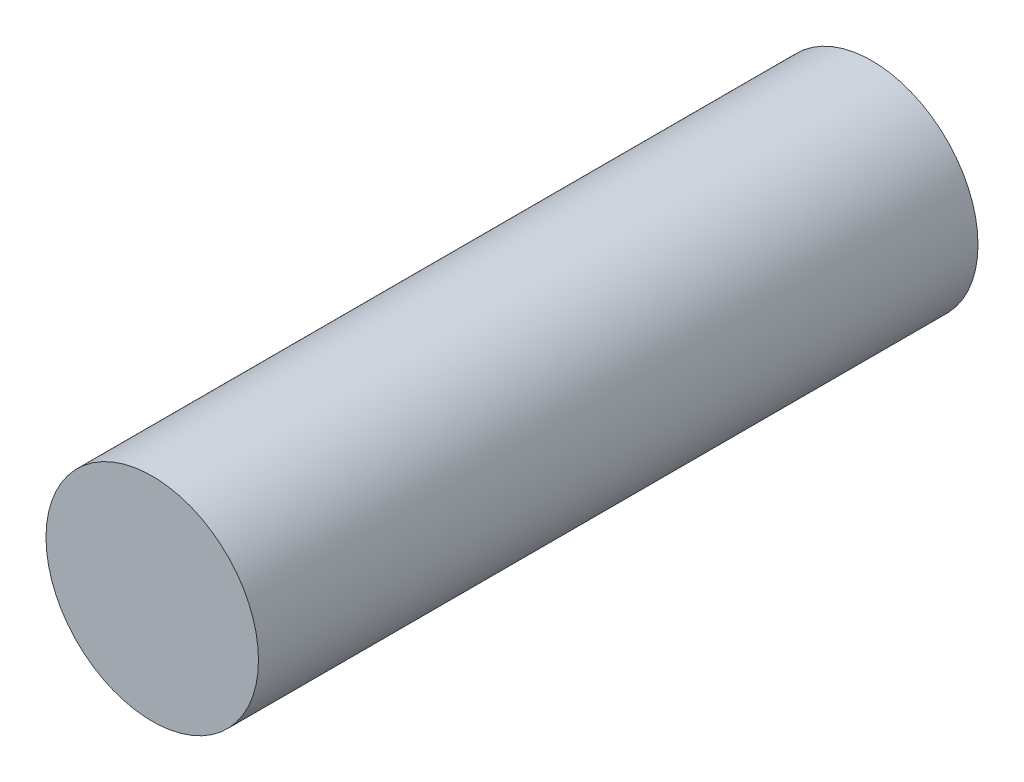
ISO-10303-21;
HEADER;
FILE_DESCRIPTION(('STEP AP214'),'2;1');
FILE_NAME('part.step','',(''),(''),'','','');
FILE_SCHEMA(('AUTOMOTIVE_DESIGN { 1 0 10303 214 1 1 1 1 }'));
ENDSEC;
DATA;
#1=APPLICATION_CONTEXT('core data for automotive mechanical design processes');
#2=APPLICATION_PROTOCOL_DEFINITION('international standard','automotive_design',2000,#1);
#3=PRODUCT_CONTEXT('',#1,'mechanical');
#4=PRODUCT('Part','Part','',(#3));
#5=PRODUCT_RELATED_PRODUCT_CATEGORY('part','',(#4));
#6=PRODUCT_DEFINITION_FORMATION('','',#4);
#7=PRODUCT_DEFINITION_CONTEXT('part definition',#1,'design');
#8=PRODUCT_DEFINITION('design','',#6,#7);
#9=PRODUCT_DEFINITION_SHAPE('','',#8);
#10=(LENGTH_UNIT() NAMED_UNIT(*) SI_UNIT(.MILLI.,.METRE.));
#11=(NAMED_UNIT(*) PLANE_ANGLE_UNIT() SI_UNIT($,.RADIAN.));
#12=(NAMED_UNIT(*) SI_UNIT($,.STERADIAN.) SOLID_ANGLE_UNIT());
#13=UNCERTAINTY_MEASURE_WITH_UNIT(LENGTH_MEASURE(1.E-05),#10,'distance_accuracy_value','');
#14=(GEOMETRIC_REPRESENTATION_CONTEXT(3) GLOBAL_UNCERTAINTY_ASSIGNED_CONTEXT((#13)) GLOBAL_UNIT_ASSIGNED_CONTEXT((#10,
#11,#12)) REPRESENTATION_CONTEXT('',''));
#15=CARTESIAN_POINT('',(0.,0.,0.));
#16=DIRECTION('',(0.,0.,1.));
#17=DIRECTION('',(1.,0.,0.));
#18=AXIS2_PLACEMENT_3D('',#15,#16,#17);
#19=CARTESIAN_POINT('',(0.,0.,150.));
#20=DIRECTION('',(0.,0.,-1.));
#21=DIRECTION('',(-1.,0.,0.));
#22=AXIS2_PLACEMENT_3D('',#19,#20,#21);
#23=CYLINDRICAL_SURFACE('',#22,22.1470871818092);
#24=CARTESIAN_POINT('',(0.,0.,150.));
#25=DIRECTION('',(0.,0.,1.));
#26=DIRECTION('',(1.,0.,0.));
#27=AXIS2_PLACEMENT_3D('',#24,#25,#26);
#28=CIRCLE('',#27,22.1470871818092);
#29=CARTESIAN_POINT('',(22.1470871818092,0.,150.));
#30=VERTEX_POINT('',#29);
#31=EDGE_CURVE('E10',#30,#30,#28,.T.);
#32=ORIENTED_EDGE('',*,*,#31,.F.);
#33=EDGE_LOOP('',(#32));
#34=FACE_BOUND('',#33,.T.);
#35=CARTESIAN_POINT('',(0.,0.,0.));
#36=DIRECTION('',(0.,0.,1.));
#37=DIRECTION('',(1.,0.,0.));
#38=AXIS2_PLACEMENT_3D('',#35,#36,#37);
#39=CIRCLE('',#38,22.1470871818092);
#40=CARTESIAN_POINT('',(22.1470871818092,0.,0.));
#41=VERTEX_POINT('',#40);
#42=EDGE_CURVE('E34',#41,#41,#39,.T.);
#43=ORIENTED_EDGE('',*,*,#42,.T.);
#44=EDGE_LOOP('',(#43));
#45=FACE_BOUND('',#44,.T.);
#46=ADVANCED_FACE('F31',(#34,#45),#23,.T.);
#47=CARTESIAN_POINT('',(0.,0.,150.));
#48=DIRECTION('',(0.,0.,1.));
#49=DIRECTION('',(1.,0.,0.));
#50=AXIS2_PLACEMENT_3D('',#47,#48,#49);
#51=PLANE('',#50);
#52=ORIENTED_EDGE('',*,*,#31,.T.);
#53=EDGE_LOOP('',(#52));
#54=FACE_BOUND('',#53,.T.);
#55=ADVANCED_FACE('F46',(#54),#51,.T.);
#56=CARTESIAN_POINT('',(0.,0.,0.));
#57=DIRECTION('',(0.,0.,1.));
#58=DIRECTION('',(1.,0.,0.));
#59=AXIS2_PLACEMENT_3D('',#56,#57,#58);
#60=PLANE('',#59);
#61=ORIENTED_EDGE('',*,*,#42,.F.);
#62=EDGE_LOOP('',(#61));
#63=FACE_BOUND('',#62,.T.);
#64=ADVANCED_FACE('F44',(#63),#60,.F.);
#65=CLOSED_SHELL('',(#46,#55,#64));
#66=MANIFOLD_SOLID_BREP('B2',#65);
#67=ADVANCED_BREP_SHAPE_REPRESENTATION('',(#18,#66),#14);
#68=SHAPE_DEFINITION_REPRESENTATION(#9,#67);
ENDSEC;
END-ISO-10303-21;
